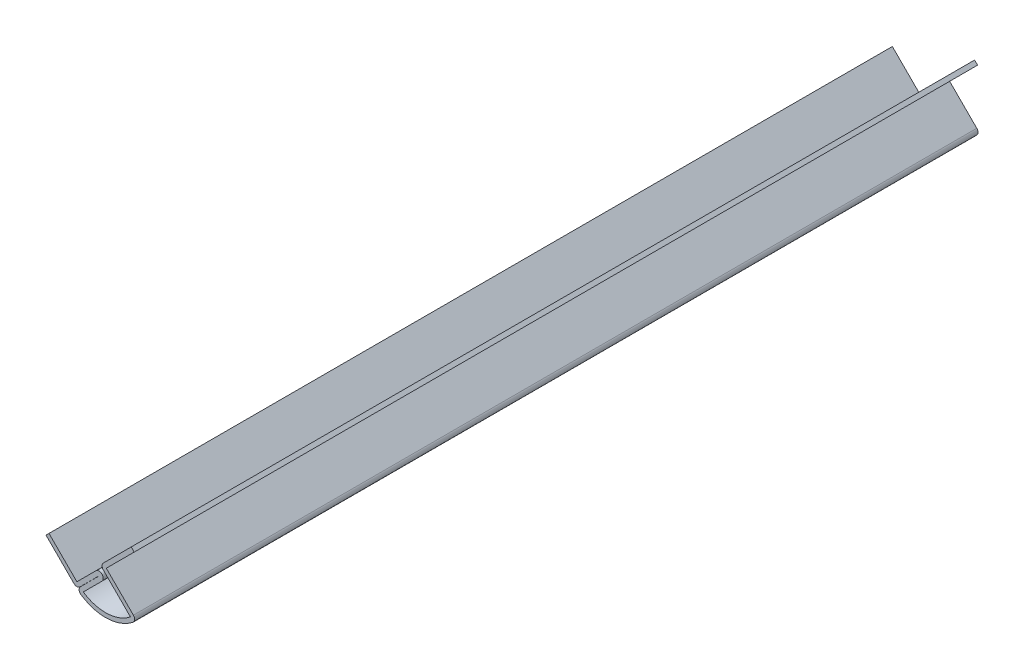
ISO-10303-21;
HEADER;
FILE_DESCRIPTION(('STEP AP214'),'2;1');
FILE_NAME('part.step','',(''),(''),'','','');
FILE_SCHEMA(('AUTOMOTIVE_DESIGN { 1 0 10303 214 1 1 1 1 }'));
ENDSEC;
DATA;
#1=APPLICATION_CONTEXT('core data for automotive mechanical design processes');
#2=APPLICATION_PROTOCOL_DEFINITION('international standard','automotive_design',2000,#1);
#3=PRODUCT_CONTEXT('',#1,'mechanical');
#4=PRODUCT('Part','Part','',(#3));
#5=PRODUCT_RELATED_PRODUCT_CATEGORY('part','',(#4));
#6=PRODUCT_DEFINITION_FORMATION('','',#4);
#7=PRODUCT_DEFINITION_CONTEXT('part definition',#1,'design');
#8=PRODUCT_DEFINITION('design','',#6,#7);
#9=PRODUCT_DEFINITION_SHAPE('','',#8);
#10=(LENGTH_UNIT() NAMED_UNIT(*) SI_UNIT(.MILLI.,.METRE.));
#11=(NAMED_UNIT(*) PLANE_ANGLE_UNIT() SI_UNIT($,.RADIAN.));
#12=(NAMED_UNIT(*) SI_UNIT($,.STERADIAN.) SOLID_ANGLE_UNIT());
#13=UNCERTAINTY_MEASURE_WITH_UNIT(LENGTH_MEASURE(1.E-05),#10,'distance_accuracy_value','');
#14=(GEOMETRIC_REPRESENTATION_CONTEXT(3) GLOBAL_UNCERTAINTY_ASSIGNED_CONTEXT((#13)) GLOBAL_UNIT_ASSIGNED_CONTEXT((#10,
#11,#12)) REPRESENTATION_CONTEXT('',''));
#15=CARTESIAN_POINT('',(0.,0.,0.));
#16=DIRECTION('',(0.,0.,1.));
#17=DIRECTION('',(1.,0.,0.));
#18=AXIS2_PLACEMENT_3D('',#15,#16,#17);
#19=CARTESIAN_POINT('',(-6.73519209080188,-6.73519209080185,-203.5175));
#20=DIRECTION('',(-0.707106781186546,0.707106781186549,0.));
#21=DIRECTION('',(-0.707106781186549,-0.707106781186546,0.));
#22=AXIS2_PLACEMENT_3D('',#19,#20,#21);
#23=PLANE('',#22);
#24=DIRECTION('',(-0.707106781186549,-0.707106781186546,0.));
#25=VECTOR('',#24,1.);
#26=CARTESIAN_POINT('',(-6.73519209080188,-6.73519209080185,0.));
#27=LINE('',#26,#25);
#28=CARTESIAN_POINT('',(-2.13056576472366,-2.13056576472365,0.));
#29=VERTEX_POINT('',#28);
#30=CARTESIAN_POINT('',(-6.73519209080188,-6.73519209080185,0.));
#31=VERTEX_POINT('',#30);
#32=EDGE_CURVE('E237',#29,#31,#27,.T.);
#33=ORIENTED_EDGE('',*,*,#32,.F.);
#34=DIRECTION('',(0.,0.,1.));
#35=VECTOR('',#34,1.);
#36=CARTESIAN_POINT('',(-2.13056576472366,-2.13056576472365,-203.5175));
#37=LINE('',#36,#35);
#38=CARTESIAN_POINT('',(-2.13056576472366,-2.13056576472365,-203.5175));
#39=VERTEX_POINT('',#38);
#40=EDGE_CURVE('E197',#39,#29,#37,.T.);
#41=ORIENTED_EDGE('',*,*,#40,.F.);
#42=DIRECTION('',(-0.707106781186549,-0.707106781186546,0.));
#43=VECTOR('',#42,1.);
#44=CARTESIAN_POINT('',(-6.73519209080188,-6.73519209080185,-203.5175));
#45=LINE('',#44,#43);
#46=CARTESIAN_POINT('',(-6.73519209080188,-6.73519209080185,-203.5175));
#47=VERTEX_POINT('',#46);
#48=EDGE_CURVE('E191',#39,#47,#45,.T.);
#49=ORIENTED_EDGE('',*,*,#48,.T.);
#50=DIRECTION('',(0.,0.,1.));
#51=VECTOR('',#50,1.);
#52=CARTESIAN_POINT('',(-6.73519209080188,-6.73519209080185,-203.5175));
#53=LINE('',#52,#51);
#54=EDGE_CURVE('E173',#47,#31,#53,.T.);
#55=ORIENTED_EDGE('',*,*,#54,.T.);
#56=EDGE_LOOP('',(#33,#41,#49,#55));
#57=FACE_BOUND('',#56,.T.);
#58=ADVANCED_FACE('F35',(#57),#23,.T.);
#59=CARTESIAN_POINT('',(-1.40316501891706,-2.85796651053026,-203.5175));
#60=DIRECTION('',(0.,0.,1.));
#61=DIRECTION('',(1.,0.,0.));
#62=AXIS2_PLACEMENT_3D('',#59,#60,#61);
#63=CYLINDRICAL_SURFACE('',#62,1.0287);
#64=CARTESIAN_POINT('',(-1.40316501891706,-2.85796651053026,0.));
#65=DIRECTION('',(0.,0.,1.));
#66=DIRECTION('',(-1.,0.,0.));
#67=AXIS2_PLACEMENT_3D('',#64,#65,#66);
#68=CIRCLE('',#67,1.0287);
#69=CARTESIAN_POINT('',(-0.67576427311046,-3.58536725633686,0.));
#70=VERTEX_POINT('',#69);
#71=EDGE_CURVE('E198',#70,#29,#68,.T.);
#72=ORIENTED_EDGE('',*,*,#71,.F.);
#73=DIRECTION('',(0.,0.,1.));
#74=VECTOR('',#73,1.);
#75=CARTESIAN_POINT('',(-0.67576427311046,-3.58536725633686,-203.5175));
#76=LINE('',#75,#74);
#77=CARTESIAN_POINT('',(-0.67576427311046,-3.58536725633686,-203.5175));
#78=VERTEX_POINT('',#77);
#79=EDGE_CURVE('E277',#78,#70,#76,.T.);
#80=ORIENTED_EDGE('',*,*,#79,.F.);
#81=CARTESIAN_POINT('',(-1.40316501891706,-2.85796651053026,-203.5175));
#82=DIRECTION('',(0.,0.,1.));
#83=DIRECTION('',(-1.,0.,0.));
#84=AXIS2_PLACEMENT_3D('',#81,#82,#83);
#85=CIRCLE('',#84,1.0287);
#86=EDGE_CURVE('E184',#78,#39,#85,.T.);
#87=ORIENTED_EDGE('',*,*,#86,.T.);
#88=ORIENTED_EDGE('',*,*,#40,.T.);
#89=EDGE_LOOP('',(#72,#80,#87,#88));
#90=FACE_BOUND('',#89,.T.);
#91=ADVANCED_FACE('F398',(#90),#63,.T.);
#92=CARTESIAN_POINT('',(-0.67576427311046,-3.58536725633686,-203.5175));
#93=DIRECTION('',(0.707106781186547,-0.707106781186548,0.));
#94=DIRECTION('',(0.707106781186548,0.707106781186547,0.));
#95=AXIS2_PLACEMENT_3D('',#92,#93,#94);
#96=PLANE('',#95);
#97=DIRECTION('',(0.707106781186548,0.707106781186547,0.));
#98=VECTOR('',#97,1.);
#99=CARTESIAN_POINT('',(-0.67576427311046,-3.58536725633686,0.));
#100=LINE('',#99,#98);
#101=CARTESIAN_POINT('',(-5.18203935936263,-8.09164234258903,0.));
#102=VERTEX_POINT('',#101);
#103=EDGE_CURVE('E201',#102,#70,#100,.T.);
#104=ORIENTED_EDGE('',*,*,#103,.F.);
#105=DIRECTION('',(0.,0.,1.));
#106=VECTOR('',#105,1.);
#107=CARTESIAN_POINT('',(-5.18203935936263,-8.09164234258903,-203.5175));
#108=LINE('',#107,#106);
#109=CARTESIAN_POINT('',(-5.18203935936263,-8.09164234258903,-203.5175));
#110=VERTEX_POINT('',#109);
#111=EDGE_CURVE('E279',#110,#102,#108,.T.);
#112=ORIENTED_EDGE('',*,*,#111,.F.);
#113=DIRECTION('',(0.707106781186548,0.707106781186547,0.));
#114=VECTOR('',#113,1.);
#115=CARTESIAN_POINT('',(-0.67576427311046,-3.58536725633686,-203.5175));
#116=LINE('',#115,#114);
#117=EDGE_CURVE('E233',#110,#78,#116,.T.);
#118=ORIENTED_EDGE('',*,*,#117,.T.);
#119=ORIENTED_EDGE('',*,*,#79,.T.);
#120=EDGE_LOOP('',(#104,#112,#118,#119));
#121=FACE_BOUND('',#120,.T.);
#122=ADVANCED_FACE('F403',(#121),#96,.T.);
#123=CARTESIAN_POINT('',(0.182905511719708,-0.221255342558643,-203.5175));
#124=DIRECTION('',(0.,0.,1.));
#125=DIRECTION('',(1.,0.,0.));
#126=AXIS2_PLACEMENT_3D('',#123,#124,#125);
#127=CYLINDRICAL_SURFACE('',#126,9.525);
#128=CARTESIAN_POINT('',(0.182905511719708,-0.221255342558643,0.));
#129=DIRECTION('',(0.,0.,-1.));
#130=DIRECTION('',(1.,0.,0.));
#131=AXIS2_PLACEMENT_3D('',#128,#129,#130);
#132=CIRCLE('',#131,9.525);
#133=CARTESIAN_POINT('',(6.18245595814791,-7.61929693751897,0.));
#134=VERTEX_POINT('',#133);
#135=EDGE_CURVE('E270',#134,#102,#132,.T.);
#136=ORIENTED_EDGE('',*,*,#135,.F.);
#137=DIRECTION('',(0.,0.,1.));
#138=VECTOR('',#137,1.);
#139=CARTESIAN_POINT('',(6.18245595814791,-7.61929693751897,-203.5175));
#140=LINE('',#139,#138);
#141=CARTESIAN_POINT('',(6.18245595814791,-7.61929693751897,-203.5175));
#142=VERTEX_POINT('',#141);
#143=EDGE_CURVE('E281',#142,#134,#140,.T.);
#144=ORIENTED_EDGE('',*,*,#143,.F.);
#145=CARTESIAN_POINT('',(0.182905511719708,-0.221255342558643,-203.5175));
#146=DIRECTION('',(0.,0.,-1.));
#147=DIRECTION('',(1.,0.,0.));
#148=AXIS2_PLACEMENT_3D('',#145,#146,#147);
#149=CIRCLE('',#148,9.525);
#150=EDGE_CURVE('E230',#142,#110,#149,.T.);
#151=ORIENTED_EDGE('',*,*,#150,.T.);
#152=ORIENTED_EDGE('',*,*,#111,.T.);
#153=EDGE_LOOP('',(#136,#144,#151,#152));
#154=FACE_BOUND('',#153,.T.);
#155=ADVANCED_FACE('F512',(#154),#127,.F.);
#156=CARTESIAN_POINT('',(6.18245595814791,-7.61929693751897,-203.5175));
#157=DIRECTION('',(-0.707106781186547,-0.707106781186548,0.));
#158=DIRECTION('',(0.707106781186548,-0.707106781186547,0.));
#159=AXIS2_PLACEMENT_3D('',#156,#157,#158);
#160=PLANE('',#159);
#161=DIRECTION('',(0.707106781186548,-0.707106781186547,0.));
#162=VECTOR('',#161,1.);
#163=CARTESIAN_POINT('',(6.18245595814791,-7.61929693751897,0.));
#164=LINE('',#163,#162);
#165=CARTESIAN_POINT('',(-0.35921024484277,-1.0776307345283,0.));
#166=VERTEX_POINT('',#165);
#167=EDGE_CURVE('E268',#166,#134,#164,.T.);
#168=ORIENTED_EDGE('',*,*,#167,.F.);
#169=DIRECTION('',(0.,0.,1.));
#170=VECTOR('',#169,1.);
#171=CARTESIAN_POINT('',(-0.359210244842768,-1.0776307345283,-203.5175));
#172=LINE('',#171,#170);
#173=CARTESIAN_POINT('',(-0.35921024484277,-1.0776307345283,-203.5175));
#174=VERTEX_POINT('',#173);
#175=EDGE_CURVE('E43',#166,#174,#172,.F.);
#176=ORIENTED_EDGE('',*,*,#175,.T.);
#177=DIRECTION('',(0.707106781186548,-0.707106781186547,0.));
#178=VECTOR('',#177,1.);
#179=CARTESIAN_POINT('',(6.18245595814791,-7.61929693751897,-203.5175));
#180=LINE('',#179,#178);
#181=EDGE_CURVE('E228',#174,#142,#180,.T.);
#182=ORIENTED_EDGE('',*,*,#181,.T.);
#183=ORIENTED_EDGE('',*,*,#143,.T.);
#184=EDGE_LOOP('',(#168,#176,#182,#183));
#185=FACE_BOUND('',#184,.T.);
#186=ADVANCED_FACE('F331',(#185),#160,.T.);
#187=CARTESIAN_POINT('',(-1.0776307345283,-0.359210244842766,-203.5175));
#188=DIRECTION('',(-0.707106781186547,0.707106781186548,0.));
#189=DIRECTION('',(-0.707106781186548,-0.707106781186547,0.));
#190=AXIS2_PLACEMENT_3D('',#187,#188,#189);
#191=PLANE('',#190);
#192=DIRECTION('',(-0.707106781186548,-0.707106781186547,0.));
#193=VECTOR('',#192,1.);
#194=CARTESIAN_POINT('',(-1.0776307345283,-0.359210244842766,-203.5175));
#195=LINE('',#194,#193);
#196=CARTESIAN_POINT('',(6.3759818459591,7.09440233564463,-203.5175));
#197=VERTEX_POINT('',#196);
#198=CARTESIAN_POINT('',(-0.359210244842768,0.359210244842766,-203.5175));
#199=VERTEX_POINT('',#198);
#200=EDGE_CURVE('E225',#197,#199,#195,.T.);
#201=ORIENTED_EDGE('',*,*,#200,.T.);
#202=DIRECTION('',(0.,0.,1.));
#203=VECTOR('',#202,1.);
#204=CARTESIAN_POINT('',(-0.359210244842768,0.359210244842766,-203.5175));
#205=LINE('',#204,#203);
#206=CARTESIAN_POINT('',(-0.359210244842768,0.359210244842766,0.));
#207=VERTEX_POINT('',#206);
#208=EDGE_CURVE('E325',#199,#207,#205,.T.);
#209=ORIENTED_EDGE('',*,*,#208,.T.);
#210=DIRECTION('',(-0.707106781186548,-0.707106781186547,0.));
#211=VECTOR('',#210,1.);
#212=CARTESIAN_POINT('',(-1.0776307345283,-0.359210244842766,0.));
#213=LINE('',#212,#211);
#214=CARTESIAN_POINT('',(6.3759818459591,7.09440233564463,0.));
#215=VERTEX_POINT('',#214);
#216=EDGE_CURVE('E265',#215,#207,#213,.T.);
#217=ORIENTED_EDGE('',*,*,#216,.F.);
#218=DIRECTION('',(0.,0.,1.));
#219=VECTOR('',#218,1.);
#220=CARTESIAN_POINT('',(6.3759818459591,7.09440233564463,-203.5175));
#221=LINE('',#220,#219);
#222=EDGE_CURVE('E284',#197,#215,#221,.T.);
#223=ORIENTED_EDGE('',*,*,#222,.F.);
#224=EDGE_LOOP('',(#201,#209,#217,#223));
#225=FACE_BOUND('',#224,.T.);
#226=ADVANCED_FACE('F342',(#225),#191,.T.);
#227=CARTESIAN_POINT('',(6.3759818459591,7.09440233564463,-203.5175));
#228=DIRECTION('',(0.707106781186547,0.707106781186548,0.));
#229=DIRECTION('',(-0.707106781186548,0.707106781186547,0.));
#230=AXIS2_PLACEMENT_3D('',#227,#228,#229);
#231=PLANE('',#230);
#232=DIRECTION('',(-0.707106781186548,0.707106781186547,0.));
#233=VECTOR('',#232,1.);
#234=CARTESIAN_POINT('',(6.3759818459591,7.09440233564463,0.));
#235=LINE('',#234,#233);
#236=CARTESIAN_POINT('',(7.09440233564464,6.3759818459591,0.));
#237=VERTEX_POINT('',#236);
#238=EDGE_CURVE('E262',#237,#215,#235,.T.);
#239=ORIENTED_EDGE('',*,*,#238,.F.);
#240=DIRECTION('',(0.,0.,1.));
#241=VECTOR('',#240,1.);
#242=CARTESIAN_POINT('',(7.09440233564464,6.3759818459591,-203.5175));
#243=LINE('',#242,#241);
#244=CARTESIAN_POINT('',(7.09440233564464,6.3759818459591,-203.5175));
#245=VERTEX_POINT('',#244);
#246=EDGE_CURVE('E286',#245,#237,#243,.T.);
#247=ORIENTED_EDGE('',*,*,#246,.F.);
#248=DIRECTION('',(-0.707106781186548,0.707106781186547,0.));
#249=VECTOR('',#248,1.);
#250=CARTESIAN_POINT('',(6.3759818459591,7.09440233564463,-203.5175));
#251=LINE('',#250,#249);
#252=EDGE_CURVE('E222',#245,#197,#251,.T.);
#253=ORIENTED_EDGE('',*,*,#252,.T.);
#254=ORIENTED_EDGE('',*,*,#222,.T.);
#255=EDGE_LOOP('',(#239,#247,#253,#254));
#256=FACE_BOUND('',#255,.T.);
#257=ADVANCED_FACE('F348',(#256),#231,.T.);
#258=CARTESIAN_POINT('',(0.359210244842768,-0.359210244842765,-203.5175));
#259=DIRECTION('',(0.707106781186547,-0.707106781186548,0.));
#260=DIRECTION('',(0.707106781186548,0.707106781186547,0.));
#261=AXIS2_PLACEMENT_3D('',#258,#259,#260);
#262=PLANE('',#261);
#263=DIRECTION('',(0.707106781186548,0.707106781186547,0.));
#264=VECTOR('',#263,1.);
#265=CARTESIAN_POINT('',(0.359210244842768,-0.359210244842765,0.));
#266=LINE('',#265,#264);
#267=CARTESIAN_POINT('',(0.359210244842768,-0.359210244842765,0.));
#268=VERTEX_POINT('',#267);
#269=EDGE_CURVE('E259',#268,#237,#266,.T.);
#270=ORIENTED_EDGE('',*,*,#269,.F.);
#271=DIRECTION('',(0.,0.,1.));
#272=VECTOR('',#271,1.);
#273=CARTESIAN_POINT('',(0.359210244842768,-0.359210244842765,-203.5175));
#274=LINE('',#273,#272);
#275=CARTESIAN_POINT('',(0.359210244842768,-0.359210244842765,-203.5175));
#276=VERTEX_POINT('',#275);
#277=EDGE_CURVE('E288',#276,#268,#274,.T.);
#278=ORIENTED_EDGE('',*,*,#277,.F.);
#279=DIRECTION('',(0.707106781186548,0.707106781186547,0.));
#280=VECTOR('',#279,1.);
#281=CARTESIAN_POINT('',(0.359210244842768,-0.359210244842765,-203.5175));
#282=LINE('',#281,#280);
#283=EDGE_CURVE('E219',#276,#245,#282,.T.);
#284=ORIENTED_EDGE('',*,*,#283,.T.);
#285=ORIENTED_EDGE('',*,*,#246,.T.);
#286=EDGE_LOOP('',(#270,#278,#284,#285));
#287=FACE_BOUND('',#286,.T.);
#288=ADVANCED_FACE('F353',(#287),#262,.T.);
#289=CARTESIAN_POINT('',(7.65566834321146,-7.65566834321145,-203.5175));
#290=DIRECTION('',(0.707106781186547,0.707106781186547,0.));
#291=DIRECTION('',(-0.707106781186548,0.707106781186548,0.));
#292=AXIS2_PLACEMENT_3D('',#289,#290,#291);
#293=PLANE('',#292);
#294=DIRECTION('',(-0.707106781186547,0.707106781186547,0.));
#295=VECTOR('',#294,1.);
#296=CARTESIAN_POINT('',(7.65566834321146,-7.65566834321145,0.));
#297=LINE('',#296,#295);
#298=CARTESIAN_POINT('',(6.90087644783344,-6.90087644783344,0.));
#299=VERTEX_POINT('',#298);
#300=EDGE_CURVE('E257',#299,#268,#297,.T.);
#301=ORIENTED_EDGE('',*,*,#300,.F.);
#302=DIRECTION('',(0.,0.,1.));
#303=VECTOR('',#302,1.);
#304=CARTESIAN_POINT('',(6.90087644783344,-6.90087644783344,-203.5175));
#305=LINE('',#304,#303);
#306=CARTESIAN_POINT('',(6.90087644783344,-6.90087644783344,-203.5175));
#307=VERTEX_POINT('',#306);
#308=EDGE_CURVE('E11',#299,#307,#305,.F.);
#309=ORIENTED_EDGE('',*,*,#308,.T.);
#310=DIRECTION('',(-0.707106781186547,0.707106781186547,0.));
#311=VECTOR('',#310,1.);
#312=CARTESIAN_POINT('',(7.65566834321146,-7.65566834321145,-203.5175));
#313=LINE('',#312,#311);
#314=EDGE_CURVE('E217',#307,#276,#313,.T.);
#315=ORIENTED_EDGE('',*,*,#314,.T.);
#316=ORIENTED_EDGE('',*,*,#277,.T.);
#317=EDGE_LOOP('',(#301,#309,#315,#316));
#318=FACE_BOUND('',#317,.T.);
#319=ADVANCED_FACE('F356',(#318),#293,.T.);
#320=CARTESIAN_POINT('',(0.182905511719708,-0.221255342558643,-203.5175));
#321=DIRECTION('',(0.,0.,1.));
#322=DIRECTION('',(1.,0.,0.));
#323=AXIS2_PLACEMENT_3D('',#320,#321,#322);
#324=CYLINDRICAL_SURFACE('',#323,10.541);
#325=CARTESIAN_POINT('',(0.182905511719708,-0.221255342558643,0.));
#326=DIRECTION('',(0.,0.,1.));
#327=DIRECTION('',(1.,0.,0.));
#328=AXIS2_PLACEMENT_3D('',#325,#326,#327);
#329=CIRCLE('',#328,10.541);
#330=CARTESIAN_POINT('',(-5.75430014561142,-8.93115028925894,0.));
#331=VERTEX_POINT('',#330);
#332=CARTESIAN_POINT('',(6.82240800576692,-8.40842137431474,0.));
#333=VERTEX_POINT('',#332);
#334=EDGE_CURVE('E254',#331,#333,#329,.T.);
#335=ORIENTED_EDGE('',*,*,#334,.F.);
#336=DIRECTION('',(0.,0.,1.));
#337=VECTOR('',#336,1.);
#338=CARTESIAN_POINT('',(-5.75430014561142,-8.93115028925894,-203.5175));
#339=LINE('',#338,#337);
#340=CARTESIAN_POINT('',(-5.75430014561142,-8.93115028925894,-203.5175));
#341=VERTEX_POINT('',#340);
#342=EDGE_CURVE('E323',#331,#341,#339,.F.);
#343=ORIENTED_EDGE('',*,*,#342,.T.);
#344=CARTESIAN_POINT('',(0.182905511719708,-0.221255342558643,-203.5175));
#345=DIRECTION('',(0.,0.,1.));
#346=DIRECTION('',(1.,0.,0.));
#347=AXIS2_PLACEMENT_3D('',#344,#345,#346);
#348=CIRCLE('',#347,10.541);
#349=CARTESIAN_POINT('',(6.82240800576692,-8.40842137431474,-203.5175));
#350=VERTEX_POINT('',#349);
#351=EDGE_CURVE('E215',#341,#350,#348,.T.);
#352=ORIENTED_EDGE('',*,*,#351,.T.);
#353=DIRECTION('',(0.,0.,1.));
#354=VECTOR('',#353,1.);
#355=CARTESIAN_POINT('',(6.82240800576692,-8.40842137431474,-203.5175));
#356=LINE('',#355,#354);
#357=EDGE_CURVE('E320',#350,#333,#356,.T.);
#358=ORIENTED_EDGE('',*,*,#357,.T.);
#359=EDGE_LOOP('',(#335,#343,#352,#358));
#360=FACE_BOUND('',#359,.T.);
#361=ADVANCED_FACE('F362',(#360),#324,.T.);
#362=CARTESIAN_POINT('',(-1.39418476279599,-2.86694676665133,-203.5175));
#363=DIRECTION('',(-0.707106781186547,0.707106781186548,0.));
#364=DIRECTION('',(-0.707106781186548,-0.707106781186547,0.));
#365=AXIS2_PLACEMENT_3D('',#362,#363,#364);
#366=PLANE('',#365);
#367=DIRECTION('',(-0.707106781186548,-0.707106781186547,0.));
#368=VECTOR('',#367,1.);
#369=CARTESIAN_POINT('',(-1.39418476279599,-2.86694676665133,-203.5175));
#370=LINE('',#369,#368);
#371=CARTESIAN_POINT('',(-1.39418476279599,-2.86694676665133,-203.5175));
#372=VERTEX_POINT('',#371);
#373=CARTESIAN_POINT('',(-5.90045984904817,-7.3732218529035,-203.5175));
#374=VERTEX_POINT('',#373);
#375=EDGE_CURVE('E213',#372,#374,#370,.T.);
#376=ORIENTED_EDGE('',*,*,#375,.T.);
#377=DIRECTION('',(0.,0.,1.));
#378=VECTOR('',#377,1.);
#379=CARTESIAN_POINT('',(-5.90045984904817,-7.3732218529035,-203.5175));
#380=LINE('',#379,#378);
#381=CARTESIAN_POINT('',(-5.90045984904817,-7.3732218529035,0.));
#382=VERTEX_POINT('',#381);
#383=EDGE_CURVE('E317',#374,#382,#380,.T.);
#384=ORIENTED_EDGE('',*,*,#383,.T.);
#385=DIRECTION('',(-0.707106781186548,-0.707106781186547,0.));
#386=VECTOR('',#385,1.);
#387=CARTESIAN_POINT('',(-1.39418476279599,-2.86694676665133,0.));
#388=LINE('',#387,#386);
#389=CARTESIAN_POINT('',(-1.39418476279599,-2.86694676665133,0.));
#390=VERTEX_POINT('',#389);
#391=EDGE_CURVE('E251',#390,#382,#388,.T.);
#392=ORIENTED_EDGE('',*,*,#391,.F.);
#393=DIRECTION('',(0.,0.,1.));
#394=VECTOR('',#393,1.);
#395=CARTESIAN_POINT('',(-1.39418476279599,-2.86694676665133,-203.5175));
#396=LINE('',#395,#394);
#397=EDGE_CURVE('E291',#372,#390,#396,.T.);
#398=ORIENTED_EDGE('',*,*,#397,.F.);
#399=EDGE_LOOP('',(#376,#384,#392,#398));
#400=FACE_BOUND('',#399,.T.);
#401=ADVANCED_FACE('F369',(#400),#366,.T.);
#402=CARTESIAN_POINT('',(-1.40316501891706,-2.85796651053026,-203.5175));
#403=DIRECTION('',(0.,0.,1.));
#404=DIRECTION('',(1.,0.,0.));
#405=AXIS2_PLACEMENT_3D('',#402,#403,#404);
#406=CYLINDRICAL_SURFACE('',#405,0.0127000000000001);
#407=CARTESIAN_POINT('',(-1.40316501891706,-2.85796651053026,0.));
#408=DIRECTION('',(0.,0.,-1.));
#409=DIRECTION('',(-1.,0.,0.));
#410=AXIS2_PLACEMENT_3D('',#407,#408,#409);
#411=CIRCLE('',#410,0.0127000000000001);
#412=CARTESIAN_POINT('',(-1.41214527503813,-2.84898625440919,0.));
#413=VERTEX_POINT('',#412);
#414=EDGE_CURVE('E248',#413,#390,#411,.T.);
#415=ORIENTED_EDGE('',*,*,#414,.F.);
#416=DIRECTION('',(0.,0.,1.));
#417=VECTOR('',#416,1.);
#418=CARTESIAN_POINT('',(-1.41214527503813,-2.84898625440919,-203.5175));
#419=LINE('',#418,#417);
#420=CARTESIAN_POINT('',(-1.41214527503813,-2.84898625440919,-203.5175));
#421=VERTEX_POINT('',#420);
#422=EDGE_CURVE('E293',#421,#413,#419,.T.);
#423=ORIENTED_EDGE('',*,*,#422,.F.);
#424=CARTESIAN_POINT('',(-1.40316501891706,-2.85796651053026,-203.5175));
#425=DIRECTION('',(0.,0.,-1.));
#426=DIRECTION('',(-1.,0.,0.));
#427=AXIS2_PLACEMENT_3D('',#424,#425,#426);
#428=CIRCLE('',#427,0.0127000000000001);
#429=EDGE_CURVE('E210',#421,#372,#428,.T.);
#430=ORIENTED_EDGE('',*,*,#429,.T.);
#431=ORIENTED_EDGE('',*,*,#397,.T.);
#432=EDGE_LOOP('',(#415,#423,#430,#431));
#433=FACE_BOUND('',#432,.T.);
#434=ADVANCED_FACE('F374',(#433),#406,.F.);
#435=CARTESIAN_POINT('',(-6.73519209080188,-8.17203307017292,-203.5175));
#436=DIRECTION('',(0.707106781186547,-0.707106781186548,0.));
#437=DIRECTION('',(0.707106781186548,0.707106781186547,0.));
#438=AXIS2_PLACEMENT_3D('',#435,#436,#437);
#439=PLANE('',#438);
#440=DIRECTION('',(0.707106781186548,0.707106781186547,0.));
#441=VECTOR('',#440,1.);
#442=CARTESIAN_POINT('',(-6.73519209080188,-8.17203307017292,0.));
#443=LINE('',#442,#441);
#444=CARTESIAN_POINT('',(-6.01677160111634,-7.45361258048739,0.));
#445=VERTEX_POINT('',#444);
#446=EDGE_CURVE('E246',#445,#413,#443,.T.);
#447=ORIENTED_EDGE('',*,*,#446,.F.);
#448=DIRECTION('',(0.,0.,1.));
#449=VECTOR('',#448,1.);
#450=CARTESIAN_POINT('',(-6.01677160111634,-7.45361258048739,-203.5175));
#451=LINE('',#450,#449);
#452=CARTESIAN_POINT('',(-6.01677160111634,-7.45361258048739,-203.5175));
#453=VERTEX_POINT('',#452);
#454=EDGE_CURVE('E309',#445,#453,#451,.F.);
#455=ORIENTED_EDGE('',*,*,#454,.T.);
#456=DIRECTION('',(0.707106781186548,0.707106781186547,0.));
#457=VECTOR('',#456,1.);
#458=CARTESIAN_POINT('',(-6.73519209080188,-8.17203307017292,-203.5175));
#459=LINE('',#458,#457);
#460=EDGE_CURVE('E208',#453,#421,#459,.T.);
#461=ORIENTED_EDGE('',*,*,#460,.T.);
#462=ORIENTED_EDGE('',*,*,#422,.T.);
#463=EDGE_LOOP('',(#447,#455,#461,#462));
#464=FACE_BOUND('',#463,.T.);
#465=ADVANCED_FACE('F377',(#464),#439,.T.);
#466=CARTESIAN_POINT('',(-6.73519209080188,-8.17203307017292,-203.5175));
#467=DIRECTION('',(-0.707106781186548,-0.707106781186548,0.));
#468=DIRECTION('',(0.707106781186548,-0.707106781186548,0.));
#469=AXIS2_PLACEMENT_3D('',#466,#467,#468);
#470=PLANE('',#469);
#471=DIRECTION('',(0.707106781186548,-0.707106781186548,0.));
#472=VECTOR('',#471,1.);
#473=CARTESIAN_POINT('',(-6.73519209080188,-8.17203307017292,-203.5175));
#474=LINE('',#473,#472);
#475=CARTESIAN_POINT('',(-14.1888046712893,-0.718420489685523,-203.5175));
#476=VERTEX_POINT('',#475);
#477=CARTESIAN_POINT('',(-7.45361258048741,-7.45361258048739,-203.5175));
#478=VERTEX_POINT('',#477);
#479=EDGE_CURVE('E205',#476,#478,#474,.T.);
#480=ORIENTED_EDGE('',*,*,#479,.T.);
#481=DIRECTION('',(0.,0.,1.));
#482=VECTOR('',#481,1.);
#483=CARTESIAN_POINT('',(-7.45361258048741,-7.45361258048739,-203.5175));
#484=LINE('',#483,#482);
#485=CARTESIAN_POINT('',(-7.45361258048741,-7.45361258048739,0.));
#486=VERTEX_POINT('',#485);
#487=EDGE_CURVE('E276',#478,#486,#484,.T.);
#488=ORIENTED_EDGE('',*,*,#487,.T.);
#489=DIRECTION('',(0.707106781186548,-0.707106781186548,0.));
#490=VECTOR('',#489,1.);
#491=CARTESIAN_POINT('',(-6.73519209080188,-8.17203307017292,0.));
#492=LINE('',#491,#490);
#493=CARTESIAN_POINT('',(-14.1888046712893,-0.718420489685523,0.));
#494=VERTEX_POINT('',#493);
#495=EDGE_CURVE('E243',#494,#486,#492,.T.);
#496=ORIENTED_EDGE('',*,*,#495,.F.);
#497=DIRECTION('',(0.,0.,1.));
#498=VECTOR('',#497,1.);
#499=CARTESIAN_POINT('',(-14.1888046712893,-0.718420489685523,-203.5175));
#500=LINE('',#499,#498);
#501=EDGE_CURVE('E296',#476,#494,#500,.T.);
#502=ORIENTED_EDGE('',*,*,#501,.F.);
#503=EDGE_LOOP('',(#480,#488,#496,#502));
#504=FACE_BOUND('',#503,.T.);
#505=ADVANCED_FACE('F385',(#504),#470,.T.);
#506=CARTESIAN_POINT('',(-14.1888046712893,-0.718420489685523,-203.5175));
#507=DIRECTION('',(-0.707106781186547,0.707106781186548,0.));
#508=DIRECTION('',(-0.707106781186548,-0.707106781186547,0.));
#509=AXIS2_PLACEMENT_3D('',#506,#507,#508);
#510=PLANE('',#509);
#511=DIRECTION('',(-0.707106781186548,-0.707106781186547,0.));
#512=VECTOR('',#511,1.);
#513=CARTESIAN_POINT('',(-14.1888046712893,-0.718420489685523,0.));
#514=LINE('',#513,#512);
#515=CARTESIAN_POINT('',(-13.4703841816037,0.,0.));
#516=VERTEX_POINT('',#515);
#517=EDGE_CURVE('E240',#516,#494,#514,.T.);
#518=ORIENTED_EDGE('',*,*,#517,.F.);
#519=DIRECTION('',(0.,0.,1.));
#520=VECTOR('',#519,1.);
#521=CARTESIAN_POINT('',(-13.4703841816037,0.,-203.5175));
#522=LINE('',#521,#520);
#523=CARTESIAN_POINT('',(-13.4703841816037,0.,-203.5175));
#524=VERTEX_POINT('',#523);
#525=EDGE_CURVE('E183',#524,#516,#522,.T.);
#526=ORIENTED_EDGE('',*,*,#525,.F.);
#527=DIRECTION('',(-0.707106781186548,-0.707106781186547,0.));
#528=VECTOR('',#527,1.);
#529=CARTESIAN_POINT('',(-14.1888046712893,-0.718420489685523,-203.5175));
#530=LINE('',#529,#528);
#531=EDGE_CURVE('E195',#524,#476,#530,.T.);
#532=ORIENTED_EDGE('',*,*,#531,.T.);
#533=ORIENTED_EDGE('',*,*,#501,.T.);
#534=EDGE_LOOP('',(#518,#526,#532,#533));
#535=FACE_BOUND('',#534,.T.);
#536=ADVANCED_FACE('F388',(#535),#510,.T.);
#537=CARTESIAN_POINT('',(-6.73519209080188,-6.73519209080185,-203.5175));
#538=DIRECTION('',(0.707106781186549,0.707106781186546,0.));
#539=DIRECTION('',(-0.707106781186546,0.707106781186549,0.));
#540=AXIS2_PLACEMENT_3D('',#537,#538,#539);
#541=PLANE('',#540);
#542=DIRECTION('',(-0.707106781186546,0.707106781186549,0.));
#543=VECTOR('',#542,1.);
#544=CARTESIAN_POINT('',(-6.73519209080188,-6.73519209080185,0.));
#545=LINE('',#544,#543);
#546=EDGE_CURVE('E178',#31,#516,#545,.T.);
#547=ORIENTED_EDGE('',*,*,#546,.F.);
#548=ORIENTED_EDGE('',*,*,#54,.F.);
#549=DIRECTION('',(-0.707106781186546,0.707106781186549,0.));
#550=VECTOR('',#549,1.);
#551=CARTESIAN_POINT('',(-6.73519209080188,-6.73519209080185,-203.5175));
#552=LINE('',#551,#550);
#553=EDGE_CURVE('E176',#47,#524,#552,.T.);
#554=ORIENTED_EDGE('',*,*,#553,.T.);
#555=ORIENTED_EDGE('',*,*,#525,.T.);
#556=EDGE_LOOP('',(#547,#548,#554,#555));
#557=FACE_BOUND('',#556,.T.);
#558=ADVANCED_FACE('F175',(#557),#541,.T.);
#559=CARTESIAN_POINT('',(-1.40316501891706,-2.85796651053026,-203.5175));
#560=DIRECTION('',(0.,0.,-1.));
#561=DIRECTION('',(-1.,0.,0.));
#562=AXIS2_PLACEMENT_3D('',#559,#560,#561);
#563=PLANE('',#562);
#564=ORIENTED_EDGE('',*,*,#460,.F.);
#565=CARTESIAN_POINT('',(-6.73519209080188,-6.73519209080186,-203.5175));
#566=DIRECTION('',(0.,0.,-1.));
#567=DIRECTION('',(-1.,0.,0.));
#568=AXIS2_PLACEMENT_3D('',#565,#566,#567);
#569=CIRCLE('',#568,1.016);
#570=EDGE_CURVE('E315',#453,#478,#569,.T.);
#571=ORIENTED_EDGE('',*,*,#570,.T.);
#572=ORIENTED_EDGE('',*,*,#479,.F.);
#573=ORIENTED_EDGE('',*,*,#531,.F.);
#574=ORIENTED_EDGE('',*,*,#553,.F.);
#575=ORIENTED_EDGE('',*,*,#48,.F.);
#576=ORIENTED_EDGE('',*,*,#86,.F.);
#577=ORIENTED_EDGE('',*,*,#117,.F.);
#578=ORIENTED_EDGE('',*,*,#150,.F.);
#579=ORIENTED_EDGE('',*,*,#181,.F.);
#580=CARTESIAN_POINT('',(0.359210244842763,-0.359210244842767,-203.5175));
#581=DIRECTION('',(0.,0.,-1.));
#582=DIRECTION('',(-1.,0.,0.));
#583=AXIS2_PLACEMENT_3D('',#580,#581,#582);
#584=CIRCLE('',#583,1.016);
#585=EDGE_CURVE('E312',#174,#199,#584,.T.);
#586=ORIENTED_EDGE('',*,*,#585,.T.);
#587=ORIENTED_EDGE('',*,*,#200,.F.);
#588=ORIENTED_EDGE('',*,*,#252,.F.);
#589=ORIENTED_EDGE('',*,*,#283,.F.);
#590=ORIENTED_EDGE('',*,*,#314,.F.);
#591=CARTESIAN_POINT('',(6.18245595814791,-7.61929693751897,-203.5175));
#592=DIRECTION('',(0.,0.,-1.));
#593=DIRECTION('',(-1.,0.,0.));
#594=AXIS2_PLACEMENT_3D('',#591,#592,#593);
#595=CIRCLE('',#594,1.016);
#596=EDGE_CURVE('E56',#307,#350,#595,.T.);
#597=ORIENTED_EDGE('',*,*,#596,.T.);
#598=ORIENTED_EDGE('',*,*,#351,.F.);
#599=CARTESIAN_POINT('',(-5.18203935936264,-8.09164234258903,-203.5175));
#600=DIRECTION('',(0.,0.,-1.));
#601=DIRECTION('',(-1.,0.,0.));
#602=AXIS2_PLACEMENT_3D('',#599,#600,#601);
#603=CIRCLE('',#602,1.016);
#604=EDGE_CURVE('E50',#341,#374,#603,.T.);
#605=ORIENTED_EDGE('',*,*,#604,.T.);
#606=ORIENTED_EDGE('',*,*,#375,.F.);
#607=ORIENTED_EDGE('',*,*,#429,.F.);
#608=EDGE_LOOP('',(#564,#571,#572,#573,#574,#575,#576,#577,#578,#579,#586,#587,#588,#589,#590,
#597,#598,#605,#606,#607));
#609=FACE_BOUND('',#608,.T.);
#610=ADVANCED_FACE('F189',(#609),#563,.T.);
#611=CARTESIAN_POINT('',(-1.40316501891706,-2.85796651053026,0.));
#612=DIRECTION('',(0.,0.,-1.));
#613=DIRECTION('',(-1.,0.,0.));
#614=AXIS2_PLACEMENT_3D('',#611,#612,#613);
#615=PLANE('',#614);
#616=ORIENTED_EDGE('',*,*,#495,.T.);
#617=CARTESIAN_POINT('',(-6.73519209080188,-6.73519209080186,0.));
#618=DIRECTION('',(0.,0.,-1.));
#619=DIRECTION('',(-1.,0.,0.));
#620=AXIS2_PLACEMENT_3D('',#617,#618,#619);
#621=CIRCLE('',#620,1.016);
#622=EDGE_CURVE('E307',#486,#445,#621,.F.);
#623=ORIENTED_EDGE('',*,*,#622,.T.);
#624=ORIENTED_EDGE('',*,*,#446,.T.);
#625=ORIENTED_EDGE('',*,*,#414,.T.);
#626=ORIENTED_EDGE('',*,*,#391,.T.);
#627=CARTESIAN_POINT('',(-5.18203935936264,-8.09164234258903,0.));
#628=DIRECTION('',(0.,0.,-1.));
#629=DIRECTION('',(-1.,0.,0.));
#630=AXIS2_PLACEMENT_3D('',#627,#628,#629);
#631=CIRCLE('',#630,1.016);
#632=EDGE_CURVE('E305',#382,#331,#631,.F.);
#633=ORIENTED_EDGE('',*,*,#632,.T.);
#634=ORIENTED_EDGE('',*,*,#334,.T.);
#635=CARTESIAN_POINT('',(6.18245595814791,-7.61929693751897,0.));
#636=DIRECTION('',(0.,0.,-1.));
#637=DIRECTION('',(-1.,0.,0.));
#638=AXIS2_PLACEMENT_3D('',#635,#636,#637);
#639=CIRCLE('',#638,1.016);
#640=EDGE_CURVE('E301',#333,#299,#639,.F.);
#641=ORIENTED_EDGE('',*,*,#640,.T.);
#642=ORIENTED_EDGE('',*,*,#300,.T.);
#643=ORIENTED_EDGE('',*,*,#269,.T.);
#644=ORIENTED_EDGE('',*,*,#238,.T.);
#645=ORIENTED_EDGE('',*,*,#216,.T.);
#646=CARTESIAN_POINT('',(0.359210244842763,-0.359210244842767,0.));
#647=DIRECTION('',(0.,0.,-1.));
#648=DIRECTION('',(-1.,0.,0.));
#649=AXIS2_PLACEMENT_3D('',#646,#647,#648);
#650=CIRCLE('',#649,1.016);
#651=EDGE_CURVE('E303',#207,#166,#650,.F.);
#652=ORIENTED_EDGE('',*,*,#651,.T.);
#653=ORIENTED_EDGE('',*,*,#167,.T.);
#654=ORIENTED_EDGE('',*,*,#135,.T.);
#655=ORIENTED_EDGE('',*,*,#103,.T.);
#656=ORIENTED_EDGE('',*,*,#71,.T.);
#657=ORIENTED_EDGE('',*,*,#32,.T.);
#658=ORIENTED_EDGE('',*,*,#546,.T.);
#659=ORIENTED_EDGE('',*,*,#517,.T.);
#660=EDGE_LOOP('',(#616,#623,#624,#625,#626,#633,#634,#641,#642,#643,#644,#645,#652,#653,#654,
#655,#656,#657,#658,#659));
#661=FACE_BOUND('',#660,.T.);
#662=ADVANCED_FACE('F344',(#661),#615,.F.);
#663=CARTESIAN_POINT('',(-6.73519209080188,-6.73519209080186,-203.5175));
#664=DIRECTION('',(0.,0.,1.));
#665=DIRECTION('',(1.,0.,0.));
#666=AXIS2_PLACEMENT_3D('',#663,#664,#665);
#667=CYLINDRICAL_SURFACE('',#666,1.016);
#668=ORIENTED_EDGE('',*,*,#570,.F.);
#669=ORIENTED_EDGE('',*,*,#454,.F.);
#670=ORIENTED_EDGE('',*,*,#622,.F.);
#671=ORIENTED_EDGE('',*,*,#487,.F.);
#672=EDGE_LOOP('',(#668,#669,#670,#671));
#673=FACE_BOUND('',#672,.T.);
#674=ADVANCED_FACE('F382',(#673),#667,.T.);
#675=CARTESIAN_POINT('',(-5.18203935936264,-8.09164234258903,-203.5175));
#676=DIRECTION('',(0.,0.,1.));
#677=DIRECTION('',(1.,0.,0.));
#678=AXIS2_PLACEMENT_3D('',#675,#676,#677);
#679=CYLINDRICAL_SURFACE('',#678,1.016);
#680=ORIENTED_EDGE('',*,*,#604,.F.);
#681=ORIENTED_EDGE('',*,*,#342,.F.);
#682=ORIENTED_EDGE('',*,*,#632,.F.);
#683=ORIENTED_EDGE('',*,*,#383,.F.);
#684=EDGE_LOOP('',(#680,#681,#682,#683));
#685=FACE_BOUND('',#684,.T.);
#686=ADVANCED_FACE('F367',(#685),#679,.T.);
#687=CARTESIAN_POINT('',(0.359210244842763,-0.359210244842767,-203.5175));
#688=DIRECTION('',(0.,0.,1.));
#689=DIRECTION('',(1.,0.,0.));
#690=AXIS2_PLACEMENT_3D('',#687,#688,#689);
#691=CYLINDRICAL_SURFACE('',#690,1.016);
#692=ORIENTED_EDGE('',*,*,#585,.F.);
#693=ORIENTED_EDGE('',*,*,#175,.F.);
#694=ORIENTED_EDGE('',*,*,#651,.F.);
#695=ORIENTED_EDGE('',*,*,#208,.F.);
#696=EDGE_LOOP('',(#692,#693,#694,#695));
#697=FACE_BOUND('',#696,.T.);
#698=ADVANCED_FACE('F339',(#697),#691,.T.);
#699=CARTESIAN_POINT('',(6.18245595814791,-7.61929693751897,-203.5175));
#700=DIRECTION('',(0.,0.,1.));
#701=DIRECTION('',(1.,0.,0.));
#702=AXIS2_PLACEMENT_3D('',#699,#700,#701);
#703=CYLINDRICAL_SURFACE('',#702,1.016);
#704=ORIENTED_EDGE('',*,*,#596,.F.);
#705=ORIENTED_EDGE('',*,*,#308,.F.);
#706=ORIENTED_EDGE('',*,*,#640,.F.);
#707=ORIENTED_EDGE('',*,*,#357,.F.);
#708=EDGE_LOOP('',(#704,#705,#706,#707));
#709=FACE_BOUND('',#708,.T.);
#710=ADVANCED_FACE('F37',(#709),#703,.T.);
#711=CLOSED_SHELL('',(#58,#91,#122,#155,#186,#226,#257,#288,#319,#361,#401,#434,#465,#505,#536,
#558,#610,#662,#674,#686,#698,#710));
#712=MANIFOLD_SOLID_BREP('B2',#711);
#713=ADVANCED_BREP_SHAPE_REPRESENTATION('',(#18,#712),#14);
#714=SHAPE_DEFINITION_REPRESENTATION(#9,#713);
ENDSEC;
END-ISO-10303-21;
